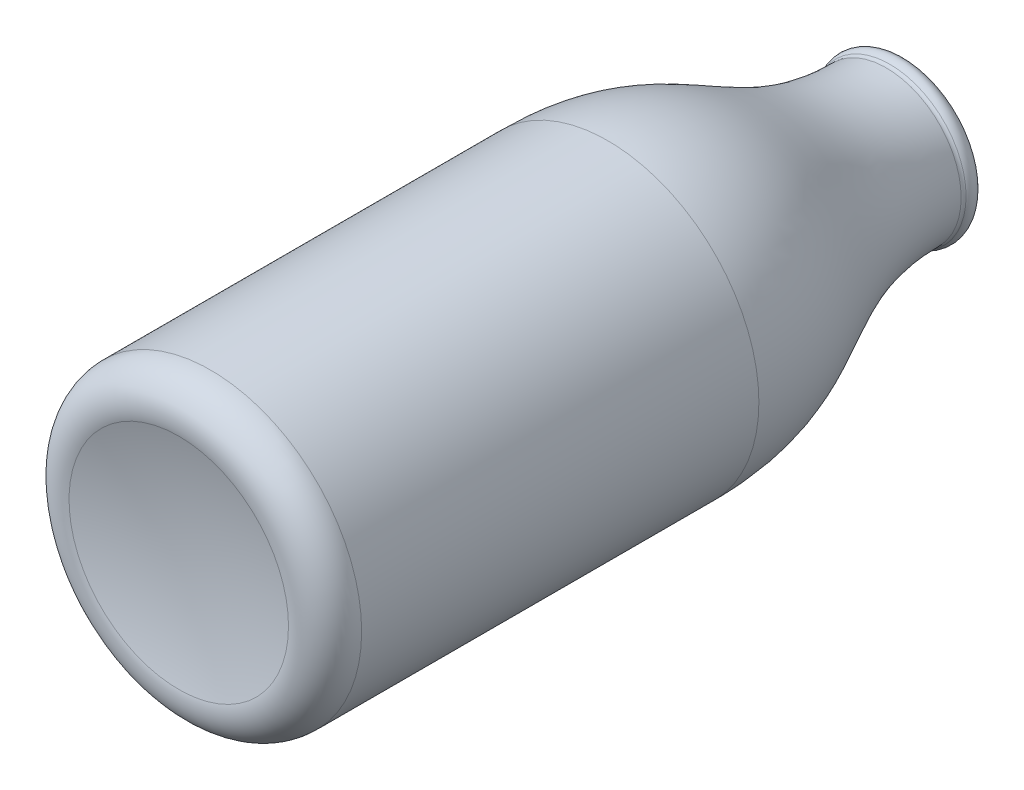
ISO-10303-21;
HEADER;
FILE_DESCRIPTION(('STEP AP214'),'2;1');
FILE_NAME('part.step','',(''),(''),'','','');
FILE_SCHEMA(('AUTOMOTIVE_DESIGN { 1 0 10303 214 1 1 1 1 }'));
ENDSEC;
DATA;
#1=APPLICATION_CONTEXT('core data for automotive mechanical design processes');
#2=APPLICATION_PROTOCOL_DEFINITION('international standard','automotive_design',2000,#1);
#3=PRODUCT_CONTEXT('',#1,'mechanical');
#4=PRODUCT('Part','Part','',(#3));
#5=PRODUCT_RELATED_PRODUCT_CATEGORY('part','',(#4));
#6=PRODUCT_DEFINITION_FORMATION('','',#4);
#7=PRODUCT_DEFINITION_CONTEXT('part definition',#1,'design');
#8=PRODUCT_DEFINITION('design','',#6,#7);
#9=PRODUCT_DEFINITION_SHAPE('','',#8);
#10=(LENGTH_UNIT() NAMED_UNIT(*) SI_UNIT(.MILLI.,.METRE.));
#11=(NAMED_UNIT(*) PLANE_ANGLE_UNIT() SI_UNIT($,.RADIAN.));
#12=(NAMED_UNIT(*) SI_UNIT($,.STERADIAN.) SOLID_ANGLE_UNIT());
#13=UNCERTAINTY_MEASURE_WITH_UNIT(LENGTH_MEASURE(1.E-05),#10,'distance_accuracy_value','');
#14=(GEOMETRIC_REPRESENTATION_CONTEXT(3) GLOBAL_UNCERTAINTY_ASSIGNED_CONTEXT((#13)) GLOBAL_UNIT_ASSIGNED_CONTEXT((#10,
#11,#12)) REPRESENTATION_CONTEXT('',''));
#15=CARTESIAN_POINT('',(0.,0.,0.));
#16=DIRECTION('',(0.,0.,1.));
#17=DIRECTION('',(1.,0.,0.));
#18=AXIS2_PLACEMENT_3D('',#15,#16,#17);
#19=CARTESIAN_POINT('',(0.,26.5020924913792,-78.7753378293878));
#20=CARTESIAN_POINT('',(0.,26.5020924913792,-85.768114647719));
#21=CARTESIAN_POINT('',(0.,24.4369637785048,-97.2235565703228));
#22=CARTESIAN_POINT('',(0.,14.6898477303883,-112.761712989742));
#23=CARTESIAN_POINT('',(0.,12.6399618432763,-123.561518893742));
#24=CARTESIAN_POINT('',(0.,12.6399618432763,-129.472123395141));
#25=B_SPLINE_CURVE_WITH_KNOTS('',3,(#19,#20,#21,#22,#23,#24),.UNSPECIFIED.,.F.,.F.,(4,1,1,4),
(0.,0.356699684018105,0.6793107788527,0.987664655163889),.UNSPECIFIED.);
#26=CARTESIAN_POINT('',(0.,0.,0.));
#27=DIRECTION('',(0.,0.,1.));
#28=AXIS1_PLACEMENT('',#26,#27);
#29=SURFACE_OF_REVOLUTION('',#25,#28);
#30=CARTESIAN_POINT('',(0.,0.,-129.472123395141));
#31=DIRECTION('',(0.,0.,1.));
#32=DIRECTION('',(1.,0.,0.));
#33=AXIS2_PLACEMENT_3D('',#30,#31,#32);
#34=CIRCLE('',#33,12.6399618432763);
#35=CARTESIAN_POINT('',(12.6399618432763,0.,-129.472123395141));
#36=VERTEX_POINT('',#35);
#37=EDGE_CURVE('E10',#36,#36,#34,.T.);
#38=ORIENTED_EDGE('',*,*,#37,.F.);
#39=EDGE_LOOP('',(#38));
#40=FACE_BOUND('',#39,.T.);
#41=CARTESIAN_POINT('',(0.,0.,-78.7753378293878));
#42=DIRECTION('',(0.,0.,1.));
#43=DIRECTION('',(1.,0.,0.));
#44=AXIS2_PLACEMENT_3D('',#41,#42,#43);
#45=CIRCLE('',#44,26.5020924913792);
#46=CARTESIAN_POINT('',(26.5020924913792,0.,-78.7753378293878));
#47=VERTEX_POINT('',#46);
#48=EDGE_CURVE('E69',#47,#47,#45,.T.);
#49=ORIENTED_EDGE('',*,*,#48,.T.);
#50=EDGE_LOOP('',(#49));
#51=FACE_BOUND('',#50,.T.);
#52=ADVANCED_FACE('F31',(#40,#51),#29,.T.);
#53=CARTESIAN_POINT('',(0.,0.,-129.472123395141));
#54=DIRECTION('',(0.,0.,1.));
#55=DIRECTION('',(1.,0.,0.));
#56=AXIS2_PLACEMENT_3D('',#53,#54,#55);
#57=CONICAL_SURFACE('',#56,12.6399618432763,0.00123288450195153);
#58=CARTESIAN_POINT('',(0.,0.,-132.246854304892));
#59=DIRECTION('',(0.,0.,1.));
#60=DIRECTION('',(1.,0.,0.));
#61=AXIS2_PLACEMENT_3D('',#58,#59,#60);
#62=CIRCLE('',#61,12.6365409188073);
#63=CARTESIAN_POINT('',(12.6365409188073,0.,-132.246854304892));
#64=VERTEX_POINT('',#63);
#65=EDGE_CURVE('E38',#64,#64,#62,.T.);
#66=ORIENTED_EDGE('',*,*,#65,.F.);
#67=EDGE_LOOP('',(#66));
#68=FACE_BOUND('',#67,.T.);
#69=ORIENTED_EDGE('',*,*,#37,.T.);
#70=EDGE_LOOP('',(#69));
#71=FACE_BOUND('',#70,.T.);
#72=ADVANCED_FACE('F99',(#68,#71),#57,.F.);
#73=CARTESIAN_POINT('',(0.,0.,-132.247470746987));
#74=DIRECTION('',(0.,0.,1.));
#75=DIRECTION('',(1.,0.,0.));
#76=AXIS2_PLACEMENT_3D('',#73,#74,#75);
#77=TOROIDAL_SURFACE('',#76,13.1365405388063,0.500000000000005);
#78=CARTESIAN_POINT('',(0.,0.,-132.697800047505));
#79=DIRECTION('',(0.,0.,1.));
#80=DIRECTION('',(1.,0.,0.));
#81=AXIS2_PLACEMENT_3D('',#78,#79,#80);
#82=CIRCLE('',#81,13.3538042520558);
#83=CARTESIAN_POINT('',(13.3538042520558,0.,-132.697800047505));
#84=VERTEX_POINT('',#83);
#85=EDGE_CURVE('E42',#84,#84,#82,.T.);
#86=ORIENTED_EDGE('',*,*,#85,.F.);
#87=EDGE_LOOP('',(#86));
#88=FACE_BOUND('',#87,.T.);
#89=ORIENTED_EDGE('',*,*,#65,.T.);
#90=EDGE_LOOP('',(#89));
#91=FACE_BOUND('',#90,.T.);
#92=ADVANCED_FACE('F96',(#88,#91),#77,.T.);
#93=CARTESIAN_POINT('',(0.,0.,-131.209534031253));
#94=DIRECTION('',(0.,0.,1.));
#95=DIRECTION('',(1.,0.,0.));
#96=AXIS2_PLACEMENT_3D('',#93,#94,#95);
#97=TOROIDAL_SURFACE('',#96,12.6357825718719,1.652419701028);
#98=CARTESIAN_POINT('',(0.,0.,-130.12715194716));
#99=DIRECTION('',(0.,0.,1.));
#100=DIRECTION('',(1.,0.,0.));
#101=AXIS2_PLACEMENT_3D('',#98,#99,#100);
#102=CIRCLE('',#101,13.8843577167395);
#103=CARTESIAN_POINT('',(13.8843577167395,0.,-130.12715194716));
#104=VERTEX_POINT('',#103);
#105=EDGE_CURVE('E46',#104,#104,#102,.T.);
#106=ORIENTED_EDGE('',*,*,#105,.F.);
#107=EDGE_LOOP('',(#106));
#108=FACE_BOUND('',#107,.T.);
#109=ORIENTED_EDGE('',*,*,#85,.T.);
#110=EDGE_LOOP('',(#109));
#111=FACE_BOUND('',#110,.T.);
#112=ADVANCED_FACE('F92',(#108,#111),#97,.T.);
#113=CARTESIAN_POINT('',(0.,0.,-129.472123395141));
#114=DIRECTION('',(0.,0.,1.));
#115=DIRECTION('',(1.,0.,0.));
#116=AXIS2_PLACEMENT_3D('',#113,#114,#115);
#117=TOROIDAL_SURFACE('',#116,14.6399618432763,1.);
#118=CARTESIAN_POINT('',(0.,0.,-129.472123395141));
#119=DIRECTION('',(0.,0.,1.));
#120=DIRECTION('',(1.,0.,0.));
#121=AXIS2_PLACEMENT_3D('',#118,#119,#120);
#122=CIRCLE('',#121,13.6399618432763);
#123=CARTESIAN_POINT('',(13.6399618432763,0.,-129.472123395141));
#124=VERTEX_POINT('',#123);
#125=EDGE_CURVE('E51',#124,#124,#122,.T.);
#126=ORIENTED_EDGE('',*,*,#125,.F.);
#127=EDGE_LOOP('',(#126));
#128=FACE_BOUND('',#127,.T.);
#129=ORIENTED_EDGE('',*,*,#105,.T.);
#130=EDGE_LOOP('',(#129));
#131=FACE_BOUND('',#130,.T.);
#132=ADVANCED_FACE('F87',(#128,#131),#117,.F.);
#133=CARTESIAN_POINT('',(0.,13.6399618432763,-129.472123395141));
#134=CARTESIAN_POINT('',(0.,13.6399618432763,-128.898157400864));
#135=CARTESIAN_POINT('',(0.,13.6596455465879,-127.741487976768));
#136=CARTESIAN_POINT('',(0.,13.7775968149759,-125.500071284291));
#137=CARTESIAN_POINT('',(0.,14.0716407623637,-122.775284135457));
#138=CARTESIAN_POINT('',(0.,14.6600488559415,-119.621935707079));
#139=CARTESIAN_POINT('',(0.,15.7506159754579,-115.535803915987));
#140=CARTESIAN_POINT('',(0.,17.7452650371598,-110.596687703911));
#141=CARTESIAN_POINT('',(0.,20.828271238291,-104.687501053595));
#142=CARTESIAN_POINT('',(0.,23.839222809557,-98.6807725309904));
#143=CARTESIAN_POINT('',(0.,25.6396728921979,-93.4906251764984));
#144=CARTESIAN_POINT('',(0.,26.616419070404,-89.1875445889138));
#145=CARTESIAN_POINT('',(0.,27.1325092680714,-85.8576433051945));
#146=CARTESIAN_POINT('',(0.,27.3855432526506,-82.9770708265913));
#147=CARTESIAN_POINT('',(0.,27.4856169360417,-80.6064020742539));
#148=CARTESIAN_POINT('',(0.,27.5020924913792,-79.3825383756181));
#149=CARTESIAN_POINT('',(0.,27.5020924913792,-78.7753378293878));
#150=B_SPLINE_CURVE_WITH_KNOTS('',3,(#133,#134,#135,#136,#137,#138,#139,#140,#141,#142,#143,
#144,#145,#146,#147,#148,#149),.UNSPECIFIED.,.F.,.F.,(4,1,1,1,1,1,1,1,1,1,1,1,1,1,4),(0.,
0.0308645204738714,0.061729040947743,0.123458081895486,0.185187122843229,0.246916163790972,
0.370374245686458,0.493832327581944,0.617290409477431,0.740748491372917,0.80247753232066,
0.864206573268403,0.925935614216146,0.956800134690017,0.987664655163889),.UNSPECIFIED.);
#151=CARTESIAN_POINT('',(0.,0.,0.));
#152=DIRECTION('',(0.,0.,1.));
#153=AXIS1_PLACEMENT('',#151,#152);
#154=SURFACE_OF_REVOLUTION('',#150,#153);
#155=CARTESIAN_POINT('',(0.,0.,-78.7753378293878));
#156=DIRECTION('',(0.,0.,1.));
#157=DIRECTION('',(1.,0.,0.));
#158=AXIS2_PLACEMENT_3D('',#155,#156,#157);
#159=CIRCLE('',#158,27.5020924913792);
#160=CARTESIAN_POINT('',(27.5020924913792,0.,-78.7753378293878));
#161=VERTEX_POINT('',#160);
#162=EDGE_CURVE('E54',#161,#161,#159,.T.);
#163=ORIENTED_EDGE('',*,*,#162,.F.);
#164=EDGE_LOOP('',(#163));
#165=FACE_BOUND('',#164,.T.);
#166=ORIENTED_EDGE('',*,*,#125,.T.);
#167=EDGE_LOOP('',(#166));
#168=FACE_BOUND('',#167,.T.);
#169=ADVANCED_FACE('F82',(#165,#168),#154,.T.);
#170=CARTESIAN_POINT('',(0.,0.,0.));
#171=DIRECTION('',(0.,0.,1.));
#172=DIRECTION('',(1.,0.,0.));
#173=AXIS2_PLACEMENT_3D('',#170,#171,#172);
#174=CYLINDRICAL_SURFACE('',#173,27.5020924913792);
#175=CARTESIAN_POINT('',(0.,0.,-6.43310772038884));
#176=DIRECTION('',(0.,0.,1.));
#177=DIRECTION('',(1.,0.,0.));
#178=AXIS2_PLACEMENT_3D('',#175,#176,#177);
#179=CIRCLE('',#178,27.5020924913792);
#180=CARTESIAN_POINT('',(27.5020924913792,0.,-6.43310772038884));
#181=VERTEX_POINT('',#180);
#182=EDGE_CURVE('E57',#181,#181,#179,.T.);
#183=ORIENTED_EDGE('',*,*,#182,.F.);
#184=EDGE_LOOP('',(#183));
#185=FACE_BOUND('',#184,.T.);
#186=ORIENTED_EDGE('',*,*,#162,.T.);
#187=EDGE_LOOP('',(#186));
#188=FACE_BOUND('',#187,.T.);
#189=ADVANCED_FACE('F86',(#185,#188),#174,.T.);
#190=CARTESIAN_POINT('',(0.,0.,-6.43310772038884));
#191=DIRECTION('',(0.,0.,1.));
#192=DIRECTION('',(1.,0.,0.));
#193=AXIS2_PLACEMENT_3D('',#190,#191,#192);
#194=TOROIDAL_SURFACE('',#193,21.5020924913792,6.);
#195=CARTESIAN_POINT('',(0.,0.,-0.628429354185556));
#196=DIRECTION('',(0.,0.,1.));
#197=DIRECTION('',(1.,0.,0.));
#198=AXIS2_PLACEMENT_3D('',#195,#196,#197);
#199=CIRCLE('',#198,19.9836363461674);
#200=CARTESIAN_POINT('',(19.9836363461674,0.,-0.628429354185556));
#201=VERTEX_POINT('',#200);
#202=EDGE_CURVE('E60',#201,#201,#199,.T.);
#203=ORIENTED_EDGE('',*,*,#202,.F.);
#204=EDGE_LOOP('',(#203));
#205=FACE_BOUND('',#204,.T.);
#206=ORIENTED_EDGE('',*,*,#182,.T.);
#207=EDGE_LOOP('',(#206));
#208=FACE_BOUND('',#207,.T.);
#209=ADVANCED_FACE('F131',(#205,#208),#194,.T.);
#210=CARTESIAN_POINT('',(0.,0.,75.7640182923621));
#211=DIRECTION('',(0.,0.,1.));
#212=DIRECTION('',(0.,1.,0.));
#213=AXIS2_PLACEMENT_3D('',#210,#211,#212);
#214=SPHERICAL_SURFACE('',#213,78.9629772681248);
#215=ORIENTED_EDGE('',*,*,#202,.T.);
#216=EDGE_LOOP('',(#215));
#217=FACE_BOUND('',#216,.T.);
#218=ADVANCED_FACE('F126',(#217),#214,.F.);
#219=CARTESIAN_POINT('',(0.,0.,75.7640182923621));
#220=DIRECTION('',(0.,0.,1.));
#221=DIRECTION('',(0.,1.,0.));
#222=AXIS2_PLACEMENT_3D('',#219,#220,#221);
#223=SPHERICAL_SURFACE('',#222,79.9629772681248);
#224=CARTESIAN_POINT('',(0.,0.,-1.59587574855276));
#225=DIRECTION('',(0.,0.,1.));
#226=DIRECTION('',(1.,0.,0.));
#227=AXIS2_PLACEMENT_3D('',#224,#225,#226);
#228=CIRCLE('',#227,20.2367123703694);
#229=CARTESIAN_POINT('',(20.2367123703694,0.,-1.59587574855276));
#230=VERTEX_POINT('',#229);
#231=EDGE_CURVE('E63',#230,#230,#228,.T.);
#232=ORIENTED_EDGE('',*,*,#231,.F.);
#233=EDGE_LOOP('',(#232));
#234=FACE_BOUND('',#233,.T.);
#235=ADVANCED_FACE('F121',(#234),#223,.T.);
#236=CARTESIAN_POINT('',(0.,0.,-6.43310772038884));
#237=DIRECTION('',(0.,0.,1.));
#238=DIRECTION('',(1.,0.,0.));
#239=AXIS2_PLACEMENT_3D('',#236,#237,#238);
#240=TOROIDAL_SURFACE('',#239,21.5020924913792,5.);
#241=CARTESIAN_POINT('',(0.,0.,-6.43310772038884));
#242=DIRECTION('',(0.,0.,1.));
#243=DIRECTION('',(1.,0.,0.));
#244=AXIS2_PLACEMENT_3D('',#241,#242,#243);
#245=CIRCLE('',#244,26.5020924913792);
#246=CARTESIAN_POINT('',(26.5020924913792,0.,-6.43310772038884));
#247=VERTEX_POINT('',#246);
#248=EDGE_CURVE('E66',#247,#247,#245,.T.);
#249=ORIENTED_EDGE('',*,*,#248,.F.);
#250=EDGE_LOOP('',(#249));
#251=FACE_BOUND('',#250,.T.);
#252=ORIENTED_EDGE('',*,*,#231,.T.);
#253=EDGE_LOOP('',(#252));
#254=FACE_BOUND('',#253,.T.);
#255=ADVANCED_FACE('F115',(#251,#254),#240,.F.);
#256=CARTESIAN_POINT('',(0.,0.,0.));
#257=DIRECTION('',(0.,0.,1.));
#258=DIRECTION('',(1.,0.,0.));
#259=AXIS2_PLACEMENT_3D('',#256,#257,#258);
#260=CYLINDRICAL_SURFACE('',#259,26.5020924913792);
#261=ORIENTED_EDGE('',*,*,#48,.F.);
#262=EDGE_LOOP('',(#261));
#263=FACE_BOUND('',#262,.T.);
#264=ORIENTED_EDGE('',*,*,#248,.T.);
#265=EDGE_LOOP('',(#264));
#266=FACE_BOUND('',#265,.T.);
#267=ADVANCED_FACE('F112',(#263,#266),#260,.F.);
#268=CLOSED_SHELL('',(#52,#72,#92,#112,#132,#169,#189,#209,#218,#235,#255,#267));
#269=MANIFOLD_SOLID_BREP('B2',#268);
#270=ADVANCED_BREP_SHAPE_REPRESENTATION('',(#18,#269),#14);
#271=SHAPE_DEFINITION_REPRESENTATION(#9,#270);
ENDSEC;
END-ISO-10303-21;
